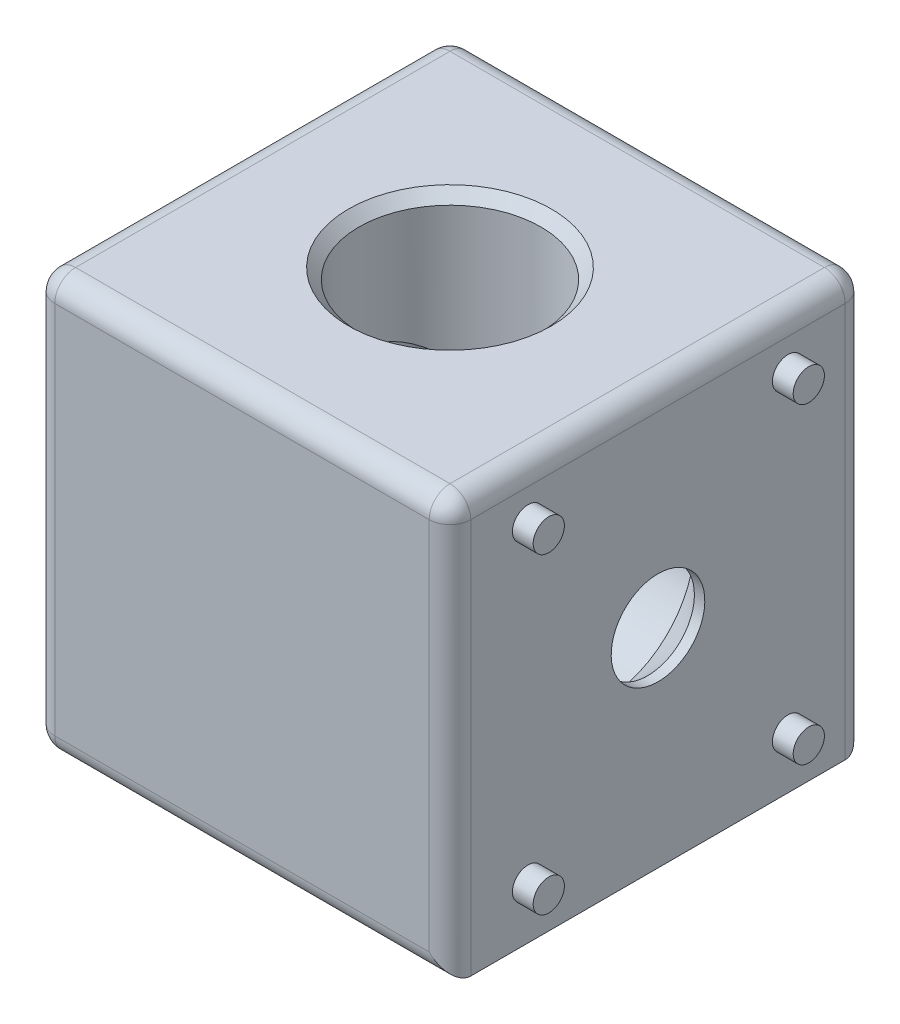
ISO-10303-21;
HEADER;
FILE_DESCRIPTION(('STEP AP214'),'2;1');
FILE_NAME('part.step','',(''),(''),'','','');
FILE_SCHEMA(('AUTOMOTIVE_DESIGN { 1 0 10303 214 1 1 1 1 }'));
ENDSEC;
DATA;
#1=APPLICATION_CONTEXT('core data for automotive mechanical design processes');
#2=APPLICATION_PROTOCOL_DEFINITION('international standard','automotive_design',2000,#1);
#3=PRODUCT_CONTEXT('',#1,'mechanical');
#4=PRODUCT('Part','Part','',(#3));
#5=PRODUCT_RELATED_PRODUCT_CATEGORY('part','',(#4));
#6=PRODUCT_DEFINITION_FORMATION('','',#4);
#7=PRODUCT_DEFINITION_CONTEXT('part definition',#1,'design');
#8=PRODUCT_DEFINITION('design','',#6,#7);
#9=PRODUCT_DEFINITION_SHAPE('','',#8);
#10=(LENGTH_UNIT() NAMED_UNIT(*) SI_UNIT(.MILLI.,.METRE.));
#11=(NAMED_UNIT(*) PLANE_ANGLE_UNIT() SI_UNIT($,.RADIAN.));
#12=(NAMED_UNIT(*) SI_UNIT($,.STERADIAN.) SOLID_ANGLE_UNIT());
#13=UNCERTAINTY_MEASURE_WITH_UNIT(LENGTH_MEASURE(1.E-05),#10,'distance_accuracy_value','');
#14=(GEOMETRIC_REPRESENTATION_CONTEXT(3) GLOBAL_UNCERTAINTY_ASSIGNED_CONTEXT((#13)) GLOBAL_UNIT_ASSIGNED_CONTEXT((#10,
#11,#12)) REPRESENTATION_CONTEXT('',''));
#15=CARTESIAN_POINT('',(0.,0.,0.));
#16=DIRECTION('',(0.,0.,1.));
#17=DIRECTION('',(1.,0.,0.));
#18=AXIS2_PLACEMENT_3D('',#15,#16,#17);
#19=CARTESIAN_POINT('',(0.,20.,0.));
#20=DIRECTION('',(0.,1.,0.));
#21=DIRECTION('',(-1.,0.,0.));
#22=AXIS2_PLACEMENT_3D('',#19,#20,#21);
#23=CYLINDRICAL_SURFACE('',#22,8.75);
#24=CARTESIAN_POINT('',(0.,19.,0.));
#25=DIRECTION('',(0.,1.,0.));
#26=DIRECTION('',(-1.,0.,0.));
#27=AXIS2_PLACEMENT_3D('',#24,#25,#26);
#28=CIRCLE('',#27,8.75);
#29=CARTESIAN_POINT('',(-8.75,19.,0.));
#30=VERTEX_POINT('',#29);
#31=EDGE_CURVE('E314',#30,#30,#28,.T.);
#32=ORIENTED_EDGE('',*,*,#31,.T.);
#33=EDGE_LOOP('',(#32));
#34=FACE_BOUND('',#33,.T.);
#35=CARTESIAN_POINT('',(0.,0.,0.));
#36=DIRECTION('',(0.707106781186547,0.707106781186548,0.));
#37=DIRECTION('',(-0.707106781186548,0.707106781186547,0.));
#38=AXIS2_PLACEMENT_3D('',#35,#36,#37);
#39=ELLIPSE('',#38,12.3743686707646,8.75);
#40=CARTESIAN_POINT('',(0.,0.,8.75));
#41=VERTEX_POINT('',#40);
#42=CARTESIAN_POINT('',(0.,0.,-8.75));
#43=VERTEX_POINT('',#42);
#44=EDGE_CURVE('E130',#41,#43,#39,.F.);
#45=ORIENTED_EDGE('',*,*,#44,.T.);
#46=CARTESIAN_POINT('',(0.,0.,0.));
#47=DIRECTION('',(-0.707106781186548,0.707106781186547,0.));
#48=DIRECTION('',(0.707106781186547,0.707106781186548,0.));
#49=AXIS2_PLACEMENT_3D('',#46,#47,#48);
#50=ELLIPSE('',#49,12.3743686707646,8.75);
#51=EDGE_CURVE('E126',#43,#41,#50,.F.);
#52=ORIENTED_EDGE('',*,*,#51,.T.);
#53=EDGE_LOOP('',(#45,#52));
#54=FACE_BOUND('',#53,.T.);
#55=ADVANCED_FACE('F34',(#34,#54),#23,.F.);
#56=CARTESIAN_POINT('',(20.,20.,20.));
#57=DIRECTION('',(-1.,0.,0.));
#58=DIRECTION('',(0.,0.,1.));
#59=AXIS2_PLACEMENT_3D('',#56,#57,#58);
#60=PLANE('',#59);
#61=DIRECTION('',(0.,0.,-1.));
#62=VECTOR('',#61,1.);
#63=CARTESIAN_POINT('',(20.,-20.,20.));
#64=LINE('',#63,#62);
#65=CARTESIAN_POINT('',(20.,-20.,18.));
#66=VERTEX_POINT('',#65);
#67=CARTESIAN_POINT('',(20.,-20.,-18.));
#68=VERTEX_POINT('',#67);
#69=EDGE_CURVE('E136',#66,#68,#64,.T.);
#70=ORIENTED_EDGE('',*,*,#69,.T.);
#71=DIRECTION('',(0.,-1.,0.));
#72=VECTOR('',#71,1.);
#73=CARTESIAN_POINT('',(20.,20.,-18.));
#74=LINE('',#73,#72);
#75=CARTESIAN_POINT('',(20.,18.,-18.));
#76=VERTEX_POINT('',#75);
#77=EDGE_CURVE('E163',#68,#76,#74,.F.);
#78=ORIENTED_EDGE('',*,*,#77,.T.);
#79=DIRECTION('',(0.,0.,-1.));
#80=VECTOR('',#79,1.);
#81=CARTESIAN_POINT('',(20.,18.,20.));
#82=LINE('',#81,#80);
#83=CARTESIAN_POINT('',(20.,18.,18.));
#84=VERTEX_POINT('',#83);
#85=EDGE_CURVE('E159',#76,#84,#82,.F.);
#86=ORIENTED_EDGE('',*,*,#85,.T.);
#87=DIRECTION('',(0.,-1.,0.));
#88=VECTOR('',#87,1.);
#89=CARTESIAN_POINT('',(20.,20.,18.));
#90=LINE('',#89,#88);
#91=EDGE_CURVE('E161',#84,#66,#90,.T.);
#92=ORIENTED_EDGE('',*,*,#91,.T.);
#93=EDGE_LOOP('',(#70,#78,#86,#92));
#94=FACE_BOUND('',#93,.T.);
#95=CARTESIAN_POINT('',(20.,-15.,12.5));
#96=DIRECTION('',(-1.,0.,0.));
#97=DIRECTION('',(0.,0.,-1.));
#98=AXIS2_PLACEMENT_3D('',#95,#96,#97);
#99=CIRCLE('',#98,1.5);
#100=CARTESIAN_POINT('',(20.,-15.,11.));
#101=VERTEX_POINT('',#100);
#102=EDGE_CURVE('E241',#101,#101,#99,.T.);
#103=ORIENTED_EDGE('',*,*,#102,.T.);
#104=EDGE_LOOP('',(#103));
#105=FACE_BOUND('',#104,.T.);
#106=CARTESIAN_POINT('',(20.,-15.,-12.5));
#107=DIRECTION('',(-1.,0.,0.));
#108=DIRECTION('',(0.,0.,-1.));
#109=AXIS2_PLACEMENT_3D('',#106,#107,#108);
#110=CIRCLE('',#109,1.5);
#111=CARTESIAN_POINT('',(20.,-15.,-14.));
#112=VERTEX_POINT('',#111);
#113=EDGE_CURVE('E252',#112,#112,#110,.T.);
#114=ORIENTED_EDGE('',*,*,#113,.T.);
#115=EDGE_LOOP('',(#114));
#116=FACE_BOUND('',#115,.T.);
#117=CARTESIAN_POINT('',(20.,15.,12.5));
#118=DIRECTION('',(-1.,0.,0.));
#119=DIRECTION('',(0.,0.,-1.));
#120=AXIS2_PLACEMENT_3D('',#117,#118,#119);
#121=CIRCLE('',#120,1.5);
#122=CARTESIAN_POINT('',(20.,15.,11.));
#123=VERTEX_POINT('',#122);
#124=EDGE_CURVE('E258',#123,#123,#121,.T.);
#125=ORIENTED_EDGE('',*,*,#124,.T.);
#126=EDGE_LOOP('',(#125));
#127=FACE_BOUND('',#126,.T.);
#128=CARTESIAN_POINT('',(20.,15.,-12.5));
#129=DIRECTION('',(-1.,0.,0.));
#130=DIRECTION('',(0.,0.,-1.));
#131=AXIS2_PLACEMENT_3D('',#128,#129,#130);
#132=CIRCLE('',#131,1.5);
#133=CARTESIAN_POINT('',(20.,15.,-14.));
#134=VERTEX_POINT('',#133);
#135=EDGE_CURVE('E264',#134,#134,#132,.T.);
#136=ORIENTED_EDGE('',*,*,#135,.T.);
#137=EDGE_LOOP('',(#136));
#138=FACE_BOUND('',#137,.T.);
#139=CARTESIAN_POINT('',(20.,0.,0.));
#140=DIRECTION('',(1.,0.,0.));
#141=DIRECTION('',(0.,1.,0.));
#142=AXIS2_PLACEMENT_3D('',#139,#140,#141);
#143=CIRCLE('',#142,4.5);
#144=CARTESIAN_POINT('',(20.,4.5,0.));
#145=VERTEX_POINT('',#144);
#146=EDGE_CURVE('E284',#145,#145,#143,.T.);
#147=ORIENTED_EDGE('',*,*,#146,.F.);
#148=EDGE_LOOP('',(#147));
#149=FACE_BOUND('',#148,.T.);
#150=ADVANCED_FACE('F329',(#94,#105,#116,#127,#138,#149),#60,.F.);
#151=CARTESIAN_POINT('',(-20.,20.,-20.));
#152=DIRECTION('',(0.,0.,1.));
#153=DIRECTION('',(1.,0.,0.));
#154=AXIS2_PLACEMENT_3D('',#151,#152,#153);
#155=PLANE('',#154);
#156=DIRECTION('',(0.,-1.,0.));
#157=VECTOR('',#156,1.);
#158=CARTESIAN_POINT('',(18.,20.,-20.));
#159=LINE('',#158,#157);
#160=CARTESIAN_POINT('',(18.,18.,-20.));
#161=VERTEX_POINT('',#160);
#162=CARTESIAN_POINT('',(18.,-18.,-20.));
#163=VERTEX_POINT('',#162);
#164=EDGE_CURVE('E147',#161,#163,#159,.T.);
#165=ORIENTED_EDGE('',*,*,#164,.T.);
#166=DIRECTION('',(-1.,0.,0.));
#167=VECTOR('',#166,1.);
#168=CARTESIAN_POINT('',(-20.,-18.,-20.));
#169=LINE('',#168,#167);
#170=CARTESIAN_POINT('',(-18.,-18.,-20.));
#171=VERTEX_POINT('',#170);
#172=EDGE_CURVE('E149',#163,#171,#169,.T.);
#173=ORIENTED_EDGE('',*,*,#172,.T.);
#174=DIRECTION('',(0.,-1.,0.));
#175=VECTOR('',#174,1.);
#176=CARTESIAN_POINT('',(-18.,20.,-20.));
#177=LINE('',#176,#175);
#178=CARTESIAN_POINT('',(-18.,18.,-20.));
#179=VERTEX_POINT('',#178);
#180=EDGE_CURVE('E145',#171,#179,#177,.F.);
#181=ORIENTED_EDGE('',*,*,#180,.T.);
#182=DIRECTION('',(-1.,0.,0.));
#183=VECTOR('',#182,1.);
#184=CARTESIAN_POINT('',(-20.,18.,-20.));
#185=LINE('',#184,#183);
#186=EDGE_CURVE('E138',#179,#161,#185,.F.);
#187=ORIENTED_EDGE('',*,*,#186,.T.);
#188=EDGE_LOOP('',(#165,#173,#181,#187));
#189=FACE_BOUND('',#188,.T.);
#190=ADVANCED_FACE('F370',(#189),#155,.F.);
#191=CARTESIAN_POINT('',(-20.,20.,20.));
#192=DIRECTION('',(1.,0.,0.));
#193=DIRECTION('',(0.,0.,-1.));
#194=AXIS2_PLACEMENT_3D('',#191,#192,#193);
#195=PLANE('',#194);
#196=DIRECTION('',(0.,-1.,0.));
#197=VECTOR('',#196,1.);
#198=CARTESIAN_POINT('',(-20.,20.,-18.));
#199=LINE('',#198,#197);
#200=CARTESIAN_POINT('',(-20.,18.,-18.));
#201=VERTEX_POINT('',#200);
#202=CARTESIAN_POINT('',(-20.,-18.,-18.));
#203=VERTEX_POINT('',#202);
#204=EDGE_CURVE('E174',#201,#203,#199,.T.);
#205=ORIENTED_EDGE('',*,*,#204,.T.);
#206=DIRECTION('',(0.,0.,1.));
#207=VECTOR('',#206,1.);
#208=CARTESIAN_POINT('',(-20.,-18.,20.));
#209=LINE('',#208,#207);
#210=CARTESIAN_POINT('',(-20.,-18.,18.));
#211=VERTEX_POINT('',#210);
#212=EDGE_CURVE('E180',#203,#211,#209,.T.);
#213=ORIENTED_EDGE('',*,*,#212,.T.);
#214=DIRECTION('',(0.,-1.,0.));
#215=VECTOR('',#214,1.);
#216=CARTESIAN_POINT('',(-20.,20.,18.));
#217=LINE('',#216,#215);
#218=CARTESIAN_POINT('',(-20.,18.,18.));
#219=VERTEX_POINT('',#218);
#220=EDGE_CURVE('E178',#211,#219,#217,.F.);
#221=ORIENTED_EDGE('',*,*,#220,.T.);
#222=DIRECTION('',(0.,0.,1.));
#223=VECTOR('',#222,1.);
#224=CARTESIAN_POINT('',(-20.,18.,20.));
#225=LINE('',#224,#223);
#226=EDGE_CURVE('E176',#219,#201,#225,.F.);
#227=ORIENTED_EDGE('',*,*,#226,.T.);
#228=EDGE_LOOP('',(#205,#213,#221,#227));
#229=FACE_BOUND('',#228,.T.);
#230=CARTESIAN_POINT('',(-20.,0.,0.));
#231=DIRECTION('',(1.,0.,0.));
#232=DIRECTION('',(0.,1.,0.));
#233=AXIS2_PLACEMENT_3D('',#230,#231,#232);
#234=CIRCLE('',#233,9.75);
#235=CARTESIAN_POINT('',(-20.,9.74999999999999,0.));
#236=VERTEX_POINT('',#235);
#237=EDGE_CURVE('E270',#236,#236,#234,.T.);
#238=ORIENTED_EDGE('',*,*,#237,.T.);
#239=EDGE_LOOP('',(#238));
#240=FACE_BOUND('',#239,.T.);
#241=ADVANCED_FACE('F427',(#229,#240),#195,.F.);
#242=CARTESIAN_POINT('',(-20.,20.,20.));
#243=DIRECTION('',(0.,0.,-1.));
#244=DIRECTION('',(-1.,0.,0.));
#245=AXIS2_PLACEMENT_3D('',#242,#243,#244);
#246=PLANE('',#245);
#247=DIRECTION('',(0.,-1.,0.));
#248=VECTOR('',#247,1.);
#249=CARTESIAN_POINT('',(-18.,20.,20.));
#250=LINE('',#249,#248);
#251=CARTESIAN_POINT('',(-18.,18.,20.));
#252=VERTEX_POINT('',#251);
#253=CARTESIAN_POINT('',(-18.,-18.,20.));
#254=VERTEX_POINT('',#253);
#255=EDGE_CURVE('E167',#252,#254,#250,.T.);
#256=ORIENTED_EDGE('',*,*,#255,.T.);
#257=DIRECTION('',(1.,0.,0.));
#258=VECTOR('',#257,1.);
#259=CARTESIAN_POINT('',(20.,-18.,20.));
#260=LINE('',#259,#258);
#261=CARTESIAN_POINT('',(18.,-18.,20.));
#262=VERTEX_POINT('',#261);
#263=EDGE_CURVE('E171',#254,#262,#260,.T.);
#264=ORIENTED_EDGE('',*,*,#263,.T.);
#265=DIRECTION('',(0.,-1.,0.));
#266=VECTOR('',#265,1.);
#267=CARTESIAN_POINT('',(18.,20.,20.));
#268=LINE('',#267,#266);
#269=CARTESIAN_POINT('',(18.,18.,20.));
#270=VERTEX_POINT('',#269);
#271=EDGE_CURVE('E169',#262,#270,#268,.F.);
#272=ORIENTED_EDGE('',*,*,#271,.T.);
#273=DIRECTION('',(1.,0.,0.));
#274=VECTOR('',#273,1.);
#275=CARTESIAN_POINT('',(-20.,18.,20.));
#276=LINE('',#275,#274);
#277=EDGE_CURVE('E165',#270,#252,#276,.F.);
#278=ORIENTED_EDGE('',*,*,#277,.T.);
#279=EDGE_LOOP('',(#256,#264,#272,#278));
#280=FACE_BOUND('',#279,.T.);
#281=ADVANCED_FACE('F389',(#280),#246,.F.);
#282=CARTESIAN_POINT('',(0.,20.,0.));
#283=DIRECTION('',(0.,-1.,0.));
#284=DIRECTION('',(0.,0.,-1.));
#285=AXIS2_PLACEMENT_3D('',#282,#283,#284);
#286=PLANE('',#285);
#287=DIRECTION('',(1.,0.,0.));
#288=VECTOR('',#287,1.);
#289=CARTESIAN_POINT('',(0.,20.,18.));
#290=LINE('',#289,#288);
#291=CARTESIAN_POINT('',(-18.,20.,18.));
#292=VERTEX_POINT('',#291);
#293=CARTESIAN_POINT('',(18.,20.,18.));
#294=VERTEX_POINT('',#293);
#295=EDGE_CURVE('E43',#292,#294,#290,.T.);
#296=ORIENTED_EDGE('',*,*,#295,.T.);
#297=DIRECTION('',(0.,0.,-1.));
#298=VECTOR('',#297,1.);
#299=CARTESIAN_POINT('',(18.,20.,0.));
#300=LINE('',#299,#298);
#301=CARTESIAN_POINT('',(18.,20.,-18.));
#302=VERTEX_POINT('',#301);
#303=EDGE_CURVE('E11',#294,#302,#300,.T.);
#304=ORIENTED_EDGE('',*,*,#303,.T.);
#305=DIRECTION('',(-1.,0.,0.));
#306=VECTOR('',#305,1.);
#307=CARTESIAN_POINT('',(0.,20.,-18.));
#308=LINE('',#307,#306);
#309=CARTESIAN_POINT('',(-18.,20.,-18.));
#310=VERTEX_POINT('',#309);
#311=EDGE_CURVE('E183',#302,#310,#308,.T.);
#312=ORIENTED_EDGE('',*,*,#311,.T.);
#313=DIRECTION('',(0.,0.,1.));
#314=VECTOR('',#313,1.);
#315=CARTESIAN_POINT('',(-18.,20.,0.));
#316=LINE('',#315,#314);
#317=EDGE_CURVE('E54',#310,#292,#316,.T.);
#318=ORIENTED_EDGE('',*,*,#317,.T.);
#319=EDGE_LOOP('',(#296,#304,#312,#318));
#320=FACE_BOUND('',#319,.T.);
#321=CARTESIAN_POINT('',(0.,20.,0.));
#322=DIRECTION('',(0.,1.,0.));
#323=DIRECTION('',(-1.,0.,0.));
#324=AXIS2_PLACEMENT_3D('',#321,#322,#323);
#325=CIRCLE('',#324,9.75);
#326=CARTESIAN_POINT('',(-9.75,20.,0.));
#327=VERTEX_POINT('',#326);
#328=EDGE_CURVE('E309',#327,#327,#325,.T.);
#329=ORIENTED_EDGE('',*,*,#328,.F.);
#330=EDGE_LOOP('',(#329));
#331=FACE_BOUND('',#330,.T.);
#332=ADVANCED_FACE('F386',(#320,#331),#286,.F.);
#333=CARTESIAN_POINT('',(0.,-20.,0.));
#334=DIRECTION('',(0.,-1.,0.));
#335=DIRECTION('',(0.,0.,-1.));
#336=AXIS2_PLACEMENT_3D('',#333,#334,#335);
#337=PLANE('',#336);
#338=CARTESIAN_POINT('',(15.,-20.,12.5));
#339=DIRECTION('',(0.,-1.,0.));
#340=DIRECTION('',(0.,0.,-1.));
#341=AXIS2_PLACEMENT_3D('',#338,#339,#340);
#342=CIRCLE('',#341,1.5);
#343=CARTESIAN_POINT('',(15.,-20.,11.));
#344=VERTEX_POINT('',#343);
#345=EDGE_CURVE('E287',#344,#344,#342,.T.);
#346=ORIENTED_EDGE('',*,*,#345,.F.);
#347=EDGE_LOOP('',(#346));
#348=FACE_BOUND('',#347,.T.);
#349=CARTESIAN_POINT('',(15.,-20.,-12.5));
#350=DIRECTION('',(0.,-1.,0.));
#351=DIRECTION('',(0.,0.,-1.));
#352=AXIS2_PLACEMENT_3D('',#349,#350,#351);
#353=CIRCLE('',#352,1.5);
#354=CARTESIAN_POINT('',(15.,-20.,-14.));
#355=VERTEX_POINT('',#354);
#356=EDGE_CURVE('E291',#355,#355,#353,.T.);
#357=ORIENTED_EDGE('',*,*,#356,.F.);
#358=EDGE_LOOP('',(#357));
#359=FACE_BOUND('',#358,.T.);
#360=CARTESIAN_POINT('',(-15.,-20.,12.5));
#361=DIRECTION('',(0.,-1.,0.));
#362=DIRECTION('',(0.,0.,-1.));
#363=AXIS2_PLACEMENT_3D('',#360,#361,#362);
#364=CIRCLE('',#363,1.5);
#365=CARTESIAN_POINT('',(-15.,-20.,11.));
#366=VERTEX_POINT('',#365);
#367=EDGE_CURVE('E297',#366,#366,#364,.T.);
#368=ORIENTED_EDGE('',*,*,#367,.F.);
#369=EDGE_LOOP('',(#368));
#370=FACE_BOUND('',#369,.T.);
#371=CARTESIAN_POINT('',(-15.,-20.,-12.5));
#372=DIRECTION('',(0.,-1.,0.));
#373=DIRECTION('',(0.,0.,-1.));
#374=AXIS2_PLACEMENT_3D('',#371,#372,#373);
#375=CIRCLE('',#374,1.5);
#376=CARTESIAN_POINT('',(-15.,-20.,-14.));
#377=VERTEX_POINT('',#376);
#378=EDGE_CURVE('E303',#377,#377,#375,.T.);
#379=ORIENTED_EDGE('',*,*,#378,.F.);
#380=EDGE_LOOP('',(#379));
#381=FACE_BOUND('',#380,.T.);
#382=CARTESIAN_POINT('',(0.,-20.,0.));
#383=DIRECTION('',(0.,1.,0.));
#384=DIRECTION('',(-1.,0.,0.));
#385=AXIS2_PLACEMENT_3D('',#382,#383,#384);
#386=CIRCLE('',#385,4.5);
#387=CARTESIAN_POINT('',(-4.5,-20.,0.));
#388=VERTEX_POINT('',#387);
#389=EDGE_CURVE('E323',#388,#388,#386,.T.);
#390=ORIENTED_EDGE('',*,*,#389,.T.);
#391=EDGE_LOOP('',(#390));
#392=FACE_BOUND('',#391,.T.);
#393=DIRECTION('',(0.,0.,1.));
#394=VECTOR('',#393,1.);
#395=CARTESIAN_POINT('',(-18.,-20.,-20.));
#396=LINE('',#395,#394);
#397=CARTESIAN_POINT('',(-18.,-20.,18.));
#398=VERTEX_POINT('',#397);
#399=CARTESIAN_POINT('',(-18.,-20.,-18.));
#400=VERTEX_POINT('',#399);
#401=EDGE_CURVE('E152',#398,#400,#396,.F.);
#402=ORIENTED_EDGE('',*,*,#401,.T.);
#403=DIRECTION('',(-1.,0.,0.));
#404=VECTOR('',#403,1.);
#405=CARTESIAN_POINT('',(20.,-20.,-18.));
#406=LINE('',#405,#404);
#407=EDGE_CURVE('E156',#400,#68,#406,.F.);
#408=ORIENTED_EDGE('',*,*,#407,.T.);
#409=ORIENTED_EDGE('',*,*,#69,.F.);
#410=DIRECTION('',(1.,0.,0.));
#411=VECTOR('',#410,1.);
#412=CARTESIAN_POINT('',(-20.,-20.,18.));
#413=LINE('',#412,#411);
#414=EDGE_CURVE('E154',#66,#398,#413,.F.);
#415=ORIENTED_EDGE('',*,*,#414,.T.);
#416=EDGE_LOOP('',(#402,#408,#409,#415));
#417=FACE_BOUND('',#416,.T.);
#418=ADVANCED_FACE('F335',(#348,#359,#370,#381,#392,#417),#337,.T.);
#419=CARTESIAN_POINT('',(0.,20.,0.));
#420=DIRECTION('',(0.,1.,0.));
#421=DIRECTION('',(-1.,0.,0.));
#422=AXIS2_PLACEMENT_3D('',#419,#420,#421);
#423=CYLINDRICAL_SURFACE('',#422,4.5);
#424=ORIENTED_EDGE('',*,*,#389,.F.);
#425=EDGE_LOOP('',(#424));
#426=FACE_BOUND('',#425,.T.);
#427=CARTESIAN_POINT('',(0.,-19.,0.));
#428=DIRECTION('',(0.,1.,0.));
#429=DIRECTION('',(-1.,0.,0.));
#430=AXIS2_PLACEMENT_3D('',#427,#428,#429);
#431=CIRCLE('',#430,4.5);
#432=CARTESIAN_POINT('',(-4.5,-19.,0.));
#433=VERTEX_POINT('',#432);
#434=EDGE_CURVE('E320',#433,#433,#431,.T.);
#435=ORIENTED_EDGE('',*,*,#434,.T.);
#436=EDGE_LOOP('',(#435));
#437=FACE_BOUND('',#436,.T.);
#438=ADVANCED_FACE('F417',(#426,#437),#423,.F.);
#439=CARTESIAN_POINT('',(0.,-14.75,0.));
#440=DIRECTION('',(0.,1.,0.));
#441=DIRECTION('',(-1.,0.,0.));
#442=AXIS2_PLACEMENT_3D('',#439,#440,#441);
#443=CONICAL_SURFACE('',#442,8.75,0.78539816339745);
#444=ORIENTED_EDGE('',*,*,#434,.F.);
#445=EDGE_LOOP('',(#444));
#446=FACE_BOUND('',#445,.T.);
#447=CARTESIAN_POINT('',(0.,-14.75,0.));
#448=DIRECTION('',(0.,1.,0.));
#449=DIRECTION('',(-1.,0.,0.));
#450=AXIS2_PLACEMENT_3D('',#447,#448,#449);
#451=CIRCLE('',#450,8.75);
#452=CARTESIAN_POINT('',(-8.75,-14.75,0.));
#453=VERTEX_POINT('',#452);
#454=EDGE_CURVE('E317',#453,#453,#451,.T.);
#455=ORIENTED_EDGE('',*,*,#454,.T.);
#456=EDGE_LOOP('',(#455));
#457=FACE_BOUND('',#456,.T.);
#458=ADVANCED_FACE('F405',(#446,#457),#443,.F.);
#459=CARTESIAN_POINT('',(0.,0.,0.));
#460=DIRECTION('',(0.707106781186547,0.707106781186548,0.));
#461=DIRECTION('',(-0.707106781186548,0.707106781186547,0.));
#462=AXIS2_PLACEMENT_3D('',#459,#460,#461);
#463=ELLIPSE('',#462,12.3743686707646,8.75);
#464=EDGE_CURVE('E122',#41,#43,#463,.T.);
#465=ORIENTED_EDGE('',*,*,#464,.T.);
#466=CARTESIAN_POINT('',(0.,0.,0.));
#467=DIRECTION('',(-0.707106781186548,0.707106781186547,0.));
#468=DIRECTION('',(0.707106781186547,0.707106781186548,0.));
#469=AXIS2_PLACEMENT_3D('',#466,#467,#468);
#470=ELLIPSE('',#469,12.3743686707646,8.75);
#471=EDGE_CURVE('E129',#43,#41,#470,.T.);
#472=ORIENTED_EDGE('',*,*,#471,.T.);
#473=EDGE_LOOP('',(#465,#472));
#474=FACE_BOUND('',#473,.T.);
#475=ORIENTED_EDGE('',*,*,#454,.F.);
#476=EDGE_LOOP('',(#475));
#477=FACE_BOUND('',#476,.T.);
#478=ADVANCED_FACE('F140',(#474,#477),#23,.F.);
#479=CARTESIAN_POINT('',(0.,20.,0.));
#480=DIRECTION('',(0.,1.,0.));
#481=DIRECTION('',(-1.,0.,0.));
#482=AXIS2_PLACEMENT_3D('',#479,#480,#481);
#483=CONICAL_SURFACE('',#482,9.75,0.78539816339745);
#484=ORIENTED_EDGE('',*,*,#31,.F.);
#485=EDGE_LOOP('',(#484));
#486=FACE_BOUND('',#485,.T.);
#487=ORIENTED_EDGE('',*,*,#328,.T.);
#488=EDGE_LOOP('',(#487));
#489=FACE_BOUND('',#488,.T.);
#490=ADVANCED_FACE('F393',(#486,#489),#483,.F.);
#491=CARTESIAN_POINT('',(-15.,-22.,-12.5));
#492=DIRECTION('',(0.,1.,0.));
#493=DIRECTION('',(0.,0.,1.));
#494=AXIS2_PLACEMENT_3D('',#491,#492,#493);
#495=CYLINDRICAL_SURFACE('',#494,1.5);
#496=CARTESIAN_POINT('',(-15.,-22.,-12.5));
#497=DIRECTION('',(0.,-1.,0.));
#498=DIRECTION('',(0.,0.,-1.));
#499=AXIS2_PLACEMENT_3D('',#496,#497,#498);
#500=CIRCLE('',#499,1.5);
#501=CARTESIAN_POINT('',(-15.,-22.,-14.));
#502=VERTEX_POINT('',#501);
#503=EDGE_CURVE('E306',#502,#502,#500,.T.);
#504=ORIENTED_EDGE('',*,*,#503,.F.);
#505=EDGE_LOOP('',(#504));
#506=FACE_BOUND('',#505,.T.);
#507=ORIENTED_EDGE('',*,*,#378,.T.);
#508=EDGE_LOOP('',(#507));
#509=FACE_BOUND('',#508,.T.);
#510=ADVANCED_FACE('F395',(#506,#509),#495,.T.);
#511=CARTESIAN_POINT('',(-15.,-22.,-12.5));
#512=DIRECTION('',(0.,-1.,0.));
#513=DIRECTION('',(0.,0.,-1.));
#514=AXIS2_PLACEMENT_3D('',#511,#512,#513);
#515=PLANE('',#514);
#516=ORIENTED_EDGE('',*,*,#503,.T.);
#517=EDGE_LOOP('',(#516));
#518=FACE_BOUND('',#517,.T.);
#519=ADVANCED_FACE('F402',(#518),#515,.T.);
#520=CARTESIAN_POINT('',(-15.,-22.,12.5));
#521=DIRECTION('',(0.,1.,0.));
#522=DIRECTION('',(0.,0.,1.));
#523=AXIS2_PLACEMENT_3D('',#520,#521,#522);
#524=CYLINDRICAL_SURFACE('',#523,1.5);
#525=CARTESIAN_POINT('',(-15.,-22.,12.5));
#526=DIRECTION('',(0.,-1.,0.));
#527=DIRECTION('',(0.,0.,-1.));
#528=AXIS2_PLACEMENT_3D('',#525,#526,#527);
#529=CIRCLE('',#528,1.5);
#530=CARTESIAN_POINT('',(-15.,-22.,11.));
#531=VERTEX_POINT('',#530);
#532=EDGE_CURVE('E300',#531,#531,#529,.T.);
#533=ORIENTED_EDGE('',*,*,#532,.F.);
#534=EDGE_LOOP('',(#533));
#535=FACE_BOUND('',#534,.T.);
#536=ORIENTED_EDGE('',*,*,#367,.T.);
#537=EDGE_LOOP('',(#536));
#538=FACE_BOUND('',#537,.T.);
#539=ADVANCED_FACE('F526',(#535,#538),#524,.T.);
#540=CARTESIAN_POINT('',(-15.,-22.,12.5));
#541=DIRECTION('',(0.,-1.,0.));
#542=DIRECTION('',(0.,0.,-1.));
#543=AXIS2_PLACEMENT_3D('',#540,#541,#542);
#544=PLANE('',#543);
#545=ORIENTED_EDGE('',*,*,#532,.T.);
#546=EDGE_LOOP('',(#545));
#547=FACE_BOUND('',#546,.T.);
#548=ADVANCED_FACE('F522',(#547),#544,.T.);
#549=CARTESIAN_POINT('',(15.,-22.,-12.5));
#550=DIRECTION('',(0.,1.,0.));
#551=DIRECTION('',(0.,0.,1.));
#552=AXIS2_PLACEMENT_3D('',#549,#550,#551);
#553=CYLINDRICAL_SURFACE('',#552,1.5);
#554=CARTESIAN_POINT('',(15.,-22.,-12.5));
#555=DIRECTION('',(0.,-1.,0.));
#556=DIRECTION('',(0.,0.,-1.));
#557=AXIS2_PLACEMENT_3D('',#554,#555,#556);
#558=CIRCLE('',#557,1.5);
#559=CARTESIAN_POINT('',(15.,-22.,-14.));
#560=VERTEX_POINT('',#559);
#561=EDGE_CURVE('E294',#560,#560,#558,.T.);
#562=ORIENTED_EDGE('',*,*,#561,.F.);
#563=EDGE_LOOP('',(#562));
#564=FACE_BOUND('',#563,.T.);
#565=ORIENTED_EDGE('',*,*,#356,.T.);
#566=EDGE_LOOP('',(#565));
#567=FACE_BOUND('',#566,.T.);
#568=ADVANCED_FACE('F518',(#564,#567),#553,.T.);
#569=CARTESIAN_POINT('',(15.,-22.,-12.5));
#570=DIRECTION('',(0.,-1.,0.));
#571=DIRECTION('',(0.,0.,-1.));
#572=AXIS2_PLACEMENT_3D('',#569,#570,#571);
#573=PLANE('',#572);
#574=ORIENTED_EDGE('',*,*,#561,.T.);
#575=EDGE_LOOP('',(#574));
#576=FACE_BOUND('',#575,.T.);
#577=ADVANCED_FACE('F514',(#576),#573,.T.);
#578=CARTESIAN_POINT('',(15.,-22.,12.5));
#579=DIRECTION('',(0.,1.,0.));
#580=DIRECTION('',(0.,0.,1.));
#581=AXIS2_PLACEMENT_3D('',#578,#579,#580);
#582=CYLINDRICAL_SURFACE('',#581,1.5);
#583=CARTESIAN_POINT('',(15.,-22.,12.5));
#584=DIRECTION('',(0.,-1.,0.));
#585=DIRECTION('',(0.,0.,-1.));
#586=AXIS2_PLACEMENT_3D('',#583,#584,#585);
#587=CIRCLE('',#586,1.5);
#588=CARTESIAN_POINT('',(15.,-22.,11.));
#589=VERTEX_POINT('',#588);
#590=EDGE_CURVE('E288',#589,#589,#587,.T.);
#591=ORIENTED_EDGE('',*,*,#590,.F.);
#592=EDGE_LOOP('',(#591));
#593=FACE_BOUND('',#592,.T.);
#594=ORIENTED_EDGE('',*,*,#345,.T.);
#595=EDGE_LOOP('',(#594));
#596=FACE_BOUND('',#595,.T.);
#597=ADVANCED_FACE('F510',(#593,#596),#582,.T.);
#598=CARTESIAN_POINT('',(15.,-22.,12.5));
#599=DIRECTION('',(0.,-1.,0.));
#600=DIRECTION('',(0.,0.,-1.));
#601=AXIS2_PLACEMENT_3D('',#598,#599,#600);
#602=PLANE('',#601);
#603=ORIENTED_EDGE('',*,*,#590,.T.);
#604=EDGE_LOOP('',(#603));
#605=FACE_BOUND('',#604,.T.);
#606=ADVANCED_FACE('F495',(#605),#602,.T.);
#607=CARTESIAN_POINT('',(-20.,0.,0.));
#608=DIRECTION('',(-1.,0.,0.));
#609=DIRECTION('',(0.,1.,0.));
#610=AXIS2_PLACEMENT_3D('',#607,#608,#609);
#611=CYLINDRICAL_SURFACE('',#610,8.75);
#612=CARTESIAN_POINT('',(-19.,0.,0.));
#613=DIRECTION('',(1.,0.,0.));
#614=DIRECTION('',(0.,1.,0.));
#615=AXIS2_PLACEMENT_3D('',#612,#613,#614);
#616=CIRCLE('',#615,8.75);
#617=CARTESIAN_POINT('',(-19.,8.74999999999999,0.));
#618=VERTEX_POINT('',#617);
#619=EDGE_CURVE('E275',#618,#618,#616,.T.);
#620=ORIENTED_EDGE('',*,*,#619,.F.);
#621=EDGE_LOOP('',(#620));
#622=FACE_BOUND('',#621,.T.);
#623=ORIENTED_EDGE('',*,*,#44,.F.);
#624=ORIENTED_EDGE('',*,*,#471,.F.);
#625=EDGE_LOOP('',(#623,#624));
#626=FACE_BOUND('',#625,.T.);
#627=ADVANCED_FACE('F134',(#622,#626),#611,.F.);
#628=CARTESIAN_POINT('',(-20.,0.,0.));
#629=DIRECTION('',(-1.,0.,0.));
#630=DIRECTION('',(0.,1.,0.));
#631=AXIS2_PLACEMENT_3D('',#628,#629,#630);
#632=CONICAL_SURFACE('',#631,9.75,0.78539816339745);
#633=ORIENTED_EDGE('',*,*,#619,.T.);
#634=EDGE_LOOP('',(#633));
#635=FACE_BOUND('',#634,.T.);
#636=ORIENTED_EDGE('',*,*,#237,.F.);
#637=EDGE_LOOP('',(#636));
#638=FACE_BOUND('',#637,.T.);
#639=ADVANCED_FACE('F484',(#635,#638),#632,.F.);
#640=CARTESIAN_POINT('',(14.75,0.,0.));
#641=DIRECTION('',(1.,0.,0.));
#642=DIRECTION('',(0.,1.,0.));
#643=AXIS2_PLACEMENT_3D('',#640,#641,#642);
#644=CIRCLE('',#643,8.75);
#645=CARTESIAN_POINT('',(14.75,8.75,0.));
#646=VERTEX_POINT('',#645);
#647=EDGE_CURVE('E278',#646,#646,#644,.T.);
#648=ORIENTED_EDGE('',*,*,#647,.T.);
#649=EDGE_LOOP('',(#648));
#650=FACE_BOUND('',#649,.T.);
#651=ORIENTED_EDGE('',*,*,#464,.F.);
#652=ORIENTED_EDGE('',*,*,#51,.F.);
#653=EDGE_LOOP('',(#651,#652));
#654=FACE_BOUND('',#653,.T.);
#655=ADVANCED_FACE('F124',(#650,#654),#611,.F.);
#656=CARTESIAN_POINT('',(-20.,0.,0.));
#657=DIRECTION('',(-1.,0.,0.));
#658=DIRECTION('',(0.,1.,0.));
#659=AXIS2_PLACEMENT_3D('',#656,#657,#658);
#660=CYLINDRICAL_SURFACE('',#659,4.5);
#661=ORIENTED_EDGE('',*,*,#146,.T.);
#662=EDGE_LOOP('',(#661));
#663=FACE_BOUND('',#662,.T.);
#664=CARTESIAN_POINT('',(19.,0.,0.));
#665=DIRECTION('',(1.,0.,0.));
#666=DIRECTION('',(0.,1.,0.));
#667=AXIS2_PLACEMENT_3D('',#664,#665,#666);
#668=CIRCLE('',#667,4.5);
#669=CARTESIAN_POINT('',(19.,4.50000000000001,0.));
#670=VERTEX_POINT('',#669);
#671=EDGE_CURVE('E281',#670,#670,#668,.T.);
#672=ORIENTED_EDGE('',*,*,#671,.F.);
#673=EDGE_LOOP('',(#672));
#674=FACE_BOUND('',#673,.T.);
#675=ADVANCED_FACE('F492',(#663,#674),#660,.F.);
#676=CARTESIAN_POINT('',(14.75,0.,0.));
#677=DIRECTION('',(-1.,0.,0.));
#678=DIRECTION('',(0.,1.,0.));
#679=AXIS2_PLACEMENT_3D('',#676,#677,#678);
#680=CONICAL_SURFACE('',#679,8.75,0.78539816339745);
#681=ORIENTED_EDGE('',*,*,#671,.T.);
#682=EDGE_LOOP('',(#681));
#683=FACE_BOUND('',#682,.T.);
#684=ORIENTED_EDGE('',*,*,#647,.F.);
#685=EDGE_LOOP('',(#684));
#686=FACE_BOUND('',#685,.T.);
#687=ADVANCED_FACE('F501',(#683,#686),#680,.F.);
#688=CARTESIAN_POINT('',(22.,15.,-12.5));
#689=DIRECTION('',(-1.,0.,0.));
#690=DIRECTION('',(0.,-1.,0.));
#691=AXIS2_PLACEMENT_3D('',#688,#689,#690);
#692=CYLINDRICAL_SURFACE('',#691,1.5);
#693=CARTESIAN_POINT('',(22.,15.,-12.5));
#694=DIRECTION('',(-1.,0.,0.));
#695=DIRECTION('',(0.,0.,-1.));
#696=AXIS2_PLACEMENT_3D('',#693,#694,#695);
#697=CIRCLE('',#696,1.5);
#698=CARTESIAN_POINT('',(22.,15.,-14.));
#699=VERTEX_POINT('',#698);
#700=EDGE_CURVE('E267',#699,#699,#697,.T.);
#701=ORIENTED_EDGE('',*,*,#700,.T.);
#702=EDGE_LOOP('',(#701));
#703=FACE_BOUND('',#702,.T.);
#704=ORIENTED_EDGE('',*,*,#135,.F.);
#705=EDGE_LOOP('',(#704));
#706=FACE_BOUND('',#705,.T.);
#707=ADVANCED_FACE('F498',(#703,#706),#692,.T.);
#708=CARTESIAN_POINT('',(22.,15.,-12.5));
#709=DIRECTION('',(1.,0.,0.));
#710=DIRECTION('',(0.,0.,-1.));
#711=AXIS2_PLACEMENT_3D('',#708,#709,#710);
#712=PLANE('',#711);
#713=ORIENTED_EDGE('',*,*,#700,.F.);
#714=EDGE_LOOP('',(#713));
#715=FACE_BOUND('',#714,.T.);
#716=ADVANCED_FACE('F610',(#715),#712,.T.);
#717=CARTESIAN_POINT('',(22.,15.,12.5));
#718=DIRECTION('',(-1.,0.,0.));
#719=DIRECTION('',(0.,-1.,0.));
#720=AXIS2_PLACEMENT_3D('',#717,#718,#719);
#721=CYLINDRICAL_SURFACE('',#720,1.5);
#722=CARTESIAN_POINT('',(22.,15.,12.5));
#723=DIRECTION('',(-1.,0.,0.));
#724=DIRECTION('',(0.,0.,-1.));
#725=AXIS2_PLACEMENT_3D('',#722,#723,#724);
#726=CIRCLE('',#725,1.5);
#727=CARTESIAN_POINT('',(22.,15.,11.));
#728=VERTEX_POINT('',#727);
#729=EDGE_CURVE('E261',#728,#728,#726,.T.);
#730=ORIENTED_EDGE('',*,*,#729,.T.);
#731=EDGE_LOOP('',(#730));
#732=FACE_BOUND('',#731,.T.);
#733=ORIENTED_EDGE('',*,*,#124,.F.);
#734=EDGE_LOOP('',(#733));
#735=FACE_BOUND('',#734,.T.);
#736=ADVANCED_FACE('F619',(#732,#735),#721,.T.);
#737=CARTESIAN_POINT('',(22.,15.,12.5));
#738=DIRECTION('',(1.,0.,0.));
#739=DIRECTION('',(0.,0.,-1.));
#740=AXIS2_PLACEMENT_3D('',#737,#738,#739);
#741=PLANE('',#740);
#742=ORIENTED_EDGE('',*,*,#729,.F.);
#743=EDGE_LOOP('',(#742));
#744=FACE_BOUND('',#743,.T.);
#745=ADVANCED_FACE('F628',(#744),#741,.T.);
#746=CARTESIAN_POINT('',(22.,-15.,-12.5));
#747=DIRECTION('',(-1.,0.,0.));
#748=DIRECTION('',(0.,-1.,0.));
#749=AXIS2_PLACEMENT_3D('',#746,#747,#748);
#750=CYLINDRICAL_SURFACE('',#749,1.5);
#751=CARTESIAN_POINT('',(22.,-15.,-12.5));
#752=DIRECTION('',(-1.,0.,0.));
#753=DIRECTION('',(0.,0.,-1.));
#754=AXIS2_PLACEMENT_3D('',#751,#752,#753);
#755=CIRCLE('',#754,1.5);
#756=CARTESIAN_POINT('',(22.,-15.,-14.));
#757=VERTEX_POINT('',#756);
#758=EDGE_CURVE('E255',#757,#757,#755,.T.);
#759=ORIENTED_EDGE('',*,*,#758,.T.);
#760=EDGE_LOOP('',(#759));
#761=FACE_BOUND('',#760,.T.);
#762=ORIENTED_EDGE('',*,*,#113,.F.);
#763=EDGE_LOOP('',(#762));
#764=FACE_BOUND('',#763,.T.);
#765=ADVANCED_FACE('F638',(#761,#764),#750,.T.);
#766=CARTESIAN_POINT('',(22.,-15.,-12.5));
#767=DIRECTION('',(1.,0.,0.));
#768=DIRECTION('',(0.,0.,-1.));
#769=AXIS2_PLACEMENT_3D('',#766,#767,#768);
#770=PLANE('',#769);
#771=ORIENTED_EDGE('',*,*,#758,.F.);
#772=EDGE_LOOP('',(#771));
#773=FACE_BOUND('',#772,.T.);
#774=ADVANCED_FACE('F648',(#773),#770,.T.);
#775=CARTESIAN_POINT('',(22.,-15.,12.5));
#776=DIRECTION('',(-1.,0.,0.));
#777=DIRECTION('',(0.,-1.,0.));
#778=AXIS2_PLACEMENT_3D('',#775,#776,#777);
#779=CYLINDRICAL_SURFACE('',#778,1.5);
#780=CARTESIAN_POINT('',(22.,-15.,12.5));
#781=DIRECTION('',(-1.,0.,0.));
#782=DIRECTION('',(0.,0.,-1.));
#783=AXIS2_PLACEMENT_3D('',#780,#781,#782);
#784=CIRCLE('',#783,1.5);
#785=CARTESIAN_POINT('',(22.,-15.,11.));
#786=VERTEX_POINT('',#785);
#787=EDGE_CURVE('E247',#786,#786,#784,.T.);
#788=ORIENTED_EDGE('',*,*,#787,.T.);
#789=EDGE_LOOP('',(#788));
#790=FACE_BOUND('',#789,.T.);
#791=ORIENTED_EDGE('',*,*,#102,.F.);
#792=EDGE_LOOP('',(#791));
#793=FACE_BOUND('',#792,.T.);
#794=ADVANCED_FACE('F658',(#790,#793),#779,.T.);
#795=CARTESIAN_POINT('',(22.,-15.,12.5));
#796=DIRECTION('',(1.,0.,0.));
#797=DIRECTION('',(0.,0.,-1.));
#798=AXIS2_PLACEMENT_3D('',#795,#796,#797);
#799=PLANE('',#798);
#800=ORIENTED_EDGE('',*,*,#787,.F.);
#801=EDGE_LOOP('',(#800));
#802=FACE_BOUND('',#801,.T.);
#803=ADVANCED_FACE('F475',(#802),#799,.T.);
#804=CARTESIAN_POINT('',(0.,18.,18.));
#805=DIRECTION('',(1.,0.,0.));
#806=DIRECTION('',(0.,0.,-1.));
#807=AXIS2_PLACEMENT_3D('',#804,#805,#806);
#808=CYLINDRICAL_SURFACE('',#807,2.);
#809=CARTESIAN_POINT('',(-18.,18.,18.));
#810=DIRECTION('',(-1.,0.,0.));
#811=DIRECTION('',(0.,0.,1.));
#812=AXIS2_PLACEMENT_3D('',#809,#810,#811);
#813=CIRCLE('',#812,2.);
#814=EDGE_CURVE('E38',#252,#292,#813,.T.);
#815=ORIENTED_EDGE('',*,*,#814,.F.);
#816=ORIENTED_EDGE('',*,*,#277,.F.);
#817=CARTESIAN_POINT('',(18.,18.,18.));
#818=DIRECTION('',(1.,0.,0.));
#819=DIRECTION('',(0.,0.,-1.));
#820=AXIS2_PLACEMENT_3D('',#817,#818,#819);
#821=CIRCLE('',#820,2.);
#822=EDGE_CURVE('E233',#294,#270,#821,.T.);
#823=ORIENTED_EDGE('',*,*,#822,.F.);
#824=ORIENTED_EDGE('',*,*,#295,.F.);
#825=EDGE_LOOP('',(#815,#816,#823,#824));
#826=FACE_BOUND('',#825,.T.);
#827=ADVANCED_FACE('F36',(#826),#808,.T.);
#828=CARTESIAN_POINT('',(-18.,18.,18.));
#829=DIRECTION('',(0.,1.,0.));
#830=DIRECTION('',(0.,0.,1.));
#831=AXIS2_PLACEMENT_3D('',#828,#829,#830);
#832=SPHERICAL_SURFACE('',#831,2.);
#833=CARTESIAN_POINT('',(-18.,18.,18.));
#834=DIRECTION('',(0.,1.,0.));
#835=DIRECTION('',(0.,0.,1.));
#836=AXIS2_PLACEMENT_3D('',#833,#834,#835);
#837=CIRCLE('',#836,2.);
#838=EDGE_CURVE('E227',#252,#219,#837,.F.);
#839=ORIENTED_EDGE('',*,*,#838,.F.);
#840=ORIENTED_EDGE('',*,*,#814,.T.);
#841=CARTESIAN_POINT('',(-18.,18.,18.));
#842=DIRECTION('',(0.,0.,1.));
#843=DIRECTION('',(1.,0.,0.));
#844=AXIS2_PLACEMENT_3D('',#841,#842,#843);
#845=CIRCLE('',#844,2.);
#846=EDGE_CURVE('E230',#219,#292,#845,.F.);
#847=ORIENTED_EDGE('',*,*,#846,.F.);
#848=EDGE_LOOP('',(#839,#840,#847));
#849=FACE_BOUND('',#848,.T.);
#850=ADVANCED_FACE('F470',(#849),#832,.T.);
#851=CARTESIAN_POINT('',(18.,20.,18.));
#852=DIRECTION('',(0.,-1.,0.));
#853=DIRECTION('',(0.,0.,-1.));
#854=AXIS2_PLACEMENT_3D('',#851,#852,#853);
#855=CYLINDRICAL_SURFACE('',#854,2.);
#856=CARTESIAN_POINT('',(18.,18.,18.));
#857=DIRECTION('',(0.,1.,0.));
#858=DIRECTION('',(0.,0.,1.));
#859=AXIS2_PLACEMENT_3D('',#856,#857,#858);
#860=CIRCLE('',#859,2.);
#861=EDGE_CURVE('E235',#270,#84,#860,.T.);
#862=ORIENTED_EDGE('',*,*,#861,.F.);
#863=ORIENTED_EDGE('',*,*,#271,.F.);
#864=CARTESIAN_POINT('',(18.,-18.,18.));
#865=DIRECTION('',(-0.707106781186547,-0.707106781186547,0.));
#866=DIRECTION('',(0.707106781186547,-0.707106781186547,0.));
#867=AXIS2_PLACEMENT_3D('',#864,#865,#866);
#868=ELLIPSE('',#867,2.82842712474619,2.);
#869=EDGE_CURVE('E225',#66,#262,#868,.T.);
#870=ORIENTED_EDGE('',*,*,#869,.F.);
#871=ORIENTED_EDGE('',*,*,#91,.F.);
#872=EDGE_LOOP('',(#862,#863,#870,#871));
#873=FACE_BOUND('',#872,.T.);
#874=ADVANCED_FACE('F341',(#873),#855,.T.);
#875=CARTESIAN_POINT('',(18.,18.,18.));
#876=DIRECTION('',(0.,0.,1.));
#877=DIRECTION('',(1.,0.,0.));
#878=AXIS2_PLACEMENT_3D('',#875,#876,#877);
#879=SPHERICAL_SURFACE('',#878,2.);
#880=ORIENTED_EDGE('',*,*,#822,.T.);
#881=ORIENTED_EDGE('',*,*,#861,.T.);
#882=CARTESIAN_POINT('',(18.,18.,18.));
#883=DIRECTION('',(0.,0.,1.));
#884=DIRECTION('',(1.,0.,0.));
#885=AXIS2_PLACEMENT_3D('',#882,#883,#884);
#886=CIRCLE('',#885,2.);
#887=EDGE_CURVE('E222',#294,#84,#886,.F.);
#888=ORIENTED_EDGE('',*,*,#887,.F.);
#889=EDGE_LOOP('',(#880,#881,#888));
#890=FACE_BOUND('',#889,.T.);
#891=ADVANCED_FACE('F465',(#890),#879,.T.);
#892=CARTESIAN_POINT('',(-18.,18.,0.));
#893=DIRECTION('',(0.,0.,1.));
#894=DIRECTION('',(1.,0.,0.));
#895=AXIS2_PLACEMENT_3D('',#892,#893,#894);
#896=CYLINDRICAL_SURFACE('',#895,2.);
#897=ORIENTED_EDGE('',*,*,#846,.T.);
#898=ORIENTED_EDGE('',*,*,#317,.F.);
#899=CARTESIAN_POINT('',(-18.,18.,-18.));
#900=DIRECTION('',(0.,0.,-1.));
#901=DIRECTION('',(-1.,0.,0.));
#902=AXIS2_PLACEMENT_3D('',#899,#900,#901);
#903=CIRCLE('',#902,2.);
#904=EDGE_CURVE('E216',#201,#310,#903,.T.);
#905=ORIENTED_EDGE('',*,*,#904,.F.);
#906=ORIENTED_EDGE('',*,*,#226,.F.);
#907=EDGE_LOOP('',(#897,#898,#905,#906));
#908=FACE_BOUND('',#907,.T.);
#909=ADVANCED_FACE('F461',(#908),#896,.T.);
#910=CARTESIAN_POINT('',(-18.,20.,18.));
#911=DIRECTION('',(0.,-1.,0.));
#912=DIRECTION('',(0.,0.,-1.));
#913=AXIS2_PLACEMENT_3D('',#910,#911,#912);
#914=CYLINDRICAL_SURFACE('',#913,2.);
#915=ORIENTED_EDGE('',*,*,#838,.T.);
#916=ORIENTED_EDGE('',*,*,#220,.F.);
#917=CARTESIAN_POINT('',(-18.,-18.,18.));
#918=DIRECTION('',(0.,-1.,0.));
#919=DIRECTION('',(0.,0.,-1.));
#920=AXIS2_PLACEMENT_3D('',#917,#918,#919);
#921=CIRCLE('',#920,2.);
#922=EDGE_CURVE('E213',#254,#211,#921,.T.);
#923=ORIENTED_EDGE('',*,*,#922,.F.);
#924=ORIENTED_EDGE('',*,*,#255,.F.);
#925=EDGE_LOOP('',(#915,#916,#923,#924));
#926=FACE_BOUND('',#925,.T.);
#927=ADVANCED_FACE('F458',(#926),#914,.T.);
#928=CARTESIAN_POINT('',(-20.,-18.,18.));
#929=DIRECTION('',(-1.,0.,0.));
#930=DIRECTION('',(0.,0.,1.));
#931=AXIS2_PLACEMENT_3D('',#928,#929,#930);
#932=CYLINDRICAL_SURFACE('',#931,2.);
#933=ORIENTED_EDGE('',*,*,#869,.T.);
#934=ORIENTED_EDGE('',*,*,#263,.F.);
#935=CARTESIAN_POINT('',(-18.,-18.,18.));
#936=DIRECTION('',(-1.,0.,0.));
#937=DIRECTION('',(0.,0.,1.));
#938=AXIS2_PLACEMENT_3D('',#935,#936,#937);
#939=CIRCLE('',#938,2.);
#940=EDGE_CURVE('E210',#398,#254,#939,.T.);
#941=ORIENTED_EDGE('',*,*,#940,.F.);
#942=ORIENTED_EDGE('',*,*,#414,.F.);
#943=EDGE_LOOP('',(#933,#934,#941,#942));
#944=FACE_BOUND('',#943,.T.);
#945=ADVANCED_FACE('F344',(#944),#932,.T.);
#946=CARTESIAN_POINT('',(18.,18.,0.));
#947=DIRECTION('',(0.,0.,-1.));
#948=DIRECTION('',(-1.,0.,0.));
#949=AXIS2_PLACEMENT_3D('',#946,#947,#948);
#950=CYLINDRICAL_SURFACE('',#949,2.);
#951=ORIENTED_EDGE('',*,*,#887,.T.);
#952=ORIENTED_EDGE('',*,*,#85,.F.);
#953=CARTESIAN_POINT('',(18.,18.,-18.));
#954=DIRECTION('',(0.,0.,-1.));
#955=DIRECTION('',(-1.,0.,0.));
#956=AXIS2_PLACEMENT_3D('',#953,#954,#955);
#957=CIRCLE('',#956,2.);
#958=EDGE_CURVE('E207',#302,#76,#957,.T.);
#959=ORIENTED_EDGE('',*,*,#958,.F.);
#960=ORIENTED_EDGE('',*,*,#303,.F.);
#961=EDGE_LOOP('',(#951,#952,#959,#960));
#962=FACE_BOUND('',#961,.T.);
#963=ADVANCED_FACE('F382',(#962),#950,.T.);
#964=CARTESIAN_POINT('',(0.,18.,-18.));
#965=DIRECTION('',(-1.,0.,0.));
#966=DIRECTION('',(0.,0.,1.));
#967=AXIS2_PLACEMENT_3D('',#964,#965,#966);
#968=CYLINDRICAL_SURFACE('',#967,2.);
#969=CARTESIAN_POINT('',(-18.,18.,-18.));
#970=DIRECTION('',(-1.,0.,0.));
#971=DIRECTION('',(0.,0.,1.));
#972=AXIS2_PLACEMENT_3D('',#969,#970,#971);
#973=CIRCLE('',#972,2.);
#974=EDGE_CURVE('E219',#310,#179,#973,.T.);
#975=ORIENTED_EDGE('',*,*,#974,.F.);
#976=ORIENTED_EDGE('',*,*,#311,.F.);
#977=CARTESIAN_POINT('',(18.,18.,-18.));
#978=DIRECTION('',(1.,0.,0.));
#979=DIRECTION('',(0.,1.,0.));
#980=AXIS2_PLACEMENT_3D('',#977,#978,#979);
#981=CIRCLE('',#980,2.);
#982=EDGE_CURVE('E205',#161,#302,#981,.T.);
#983=ORIENTED_EDGE('',*,*,#982,.F.);
#984=ORIENTED_EDGE('',*,*,#186,.F.);
#985=EDGE_LOOP('',(#975,#976,#983,#984));
#986=FACE_BOUND('',#985,.T.);
#987=ADVANCED_FACE('F385',(#986),#968,.T.);
#988=CARTESIAN_POINT('',(-18.,18.,-18.));
#989=DIRECTION('',(0.,1.,0.));
#990=DIRECTION('',(0.,0.,1.));
#991=AXIS2_PLACEMENT_3D('',#988,#989,#990);
#992=SPHERICAL_SURFACE('',#991,2.);
#993=ORIENTED_EDGE('',*,*,#904,.T.);
#994=ORIENTED_EDGE('',*,*,#974,.T.);
#995=CARTESIAN_POINT('',(-18.,18.,-18.));
#996=DIRECTION('',(0.,1.,0.));
#997=DIRECTION('',(0.,0.,1.));
#998=AXIS2_PLACEMENT_3D('',#995,#996,#997);
#999=CIRCLE('',#998,2.);
#1000=EDGE_CURVE('E202',#201,#179,#999,.F.);
#1001=ORIENTED_EDGE('',*,*,#1000,.F.);
#1002=EDGE_LOOP('',(#993,#994,#1001));
#1003=FACE_BOUND('',#1002,.T.);
#1004=ADVANCED_FACE('F448',(#1003),#992,.T.);
#1005=CARTESIAN_POINT('',(-18.,-18.,18.));
#1006=DIRECTION('',(0.,0.,1.));
#1007=DIRECTION('',(0.,-1.,0.));
#1008=AXIS2_PLACEMENT_3D('',#1005,#1006,#1007);
#1009=SPHERICAL_SURFACE('',#1008,2.);
#1010=ORIENTED_EDGE('',*,*,#940,.T.);
#1011=ORIENTED_EDGE('',*,*,#922,.T.);
#1012=CARTESIAN_POINT('',(-18.,-18.,18.));
#1013=DIRECTION('',(0.,0.,1.));
#1014=DIRECTION('',(1.,0.,0.));
#1015=AXIS2_PLACEMENT_3D('',#1012,#1013,#1014);
#1016=CIRCLE('',#1015,2.);
#1017=EDGE_CURVE('E200',#398,#211,#1016,.F.);
#1018=ORIENTED_EDGE('',*,*,#1017,.F.);
#1019=EDGE_LOOP('',(#1010,#1011,#1018));
#1020=FACE_BOUND('',#1019,.T.);
#1021=ADVANCED_FACE('F349',(#1020),#1009,.T.);
#1022=CARTESIAN_POINT('',(18.,18.,-18.));
#1023=DIRECTION('',(0.,1.,0.));
#1024=DIRECTION('',(0.,0.,1.));
#1025=AXIS2_PLACEMENT_3D('',#1022,#1023,#1024);
#1026=SPHERICAL_SURFACE('',#1025,2.);
#1027=ORIENTED_EDGE('',*,*,#982,.T.);
#1028=ORIENTED_EDGE('',*,*,#958,.T.);
#1029=CARTESIAN_POINT('',(18.,18.,-18.));
#1030=DIRECTION('',(0.,1.,0.));
#1031=DIRECTION('',(0.,0.,1.));
#1032=AXIS2_PLACEMENT_3D('',#1029,#1030,#1031);
#1033=CIRCLE('',#1032,2.);
#1034=EDGE_CURVE('E197',#161,#76,#1033,.F.);
#1035=ORIENTED_EDGE('',*,*,#1034,.F.);
#1036=EDGE_LOOP('',(#1027,#1028,#1035));
#1037=FACE_BOUND('',#1036,.T.);
#1038=ADVANCED_FACE('F377',(#1037),#1026,.T.);
#1039=CARTESIAN_POINT('',(-18.,20.,-18.));
#1040=DIRECTION('',(0.,-1.,0.));
#1041=DIRECTION('',(0.,0.,-1.));
#1042=AXIS2_PLACEMENT_3D('',#1039,#1040,#1041);
#1043=CYLINDRICAL_SURFACE('',#1042,2.);
#1044=ORIENTED_EDGE('',*,*,#1000,.T.);
#1045=ORIENTED_EDGE('',*,*,#180,.F.);
#1046=CARTESIAN_POINT('',(-18.,-18.,-18.));
#1047=DIRECTION('',(0.,-1.,0.));
#1048=DIRECTION('',(0.,0.,-1.));
#1049=AXIS2_PLACEMENT_3D('',#1046,#1047,#1048);
#1050=CIRCLE('',#1049,2.);
#1051=EDGE_CURVE('E194',#203,#171,#1050,.T.);
#1052=ORIENTED_EDGE('',*,*,#1051,.F.);
#1053=ORIENTED_EDGE('',*,*,#204,.F.);
#1054=EDGE_LOOP('',(#1044,#1045,#1052,#1053));
#1055=FACE_BOUND('',#1054,.T.);
#1056=ADVANCED_FACE('F366',(#1055),#1043,.T.);
#1057=CARTESIAN_POINT('',(-18.,-18.,20.));
#1058=DIRECTION('',(0.,0.,-1.));
#1059=DIRECTION('',(-1.,0.,0.));
#1060=AXIS2_PLACEMENT_3D('',#1057,#1058,#1059);
#1061=CYLINDRICAL_SURFACE('',#1060,2.);
#1062=ORIENTED_EDGE('',*,*,#1017,.T.);
#1063=ORIENTED_EDGE('',*,*,#212,.F.);
#1064=CARTESIAN_POINT('',(-18.,-18.,-18.));
#1065=DIRECTION('',(0.,0.,-1.));
#1066=DIRECTION('',(-1.,0.,0.));
#1067=AXIS2_PLACEMENT_3D('',#1064,#1065,#1066);
#1068=CIRCLE('',#1067,2.);
#1069=EDGE_CURVE('E191',#400,#203,#1068,.T.);
#1070=ORIENTED_EDGE('',*,*,#1069,.F.);
#1071=ORIENTED_EDGE('',*,*,#401,.F.);
#1072=EDGE_LOOP('',(#1062,#1063,#1070,#1071));
#1073=FACE_BOUND('',#1072,.T.);
#1074=ADVANCED_FACE('F354',(#1073),#1061,.T.);
#1075=CARTESIAN_POINT('',(18.,20.,-18.));
#1076=DIRECTION('',(0.,-1.,0.));
#1077=DIRECTION('',(0.,0.,-1.));
#1078=AXIS2_PLACEMENT_3D('',#1075,#1076,#1077);
#1079=CYLINDRICAL_SURFACE('',#1078,2.);
#1080=ORIENTED_EDGE('',*,*,#1034,.T.);
#1081=ORIENTED_EDGE('',*,*,#77,.F.);
#1082=CARTESIAN_POINT('',(18.,-18.,-18.));
#1083=DIRECTION('',(-0.707106781186547,-0.707106781186547,0.));
#1084=DIRECTION('',(0.707106781186547,-0.707106781186547,0.));
#1085=AXIS2_PLACEMENT_3D('',#1082,#1083,#1084);
#1086=ELLIPSE('',#1085,2.82842712474619,2.);
#1087=EDGE_CURVE('E189',#163,#68,#1086,.T.);
#1088=ORIENTED_EDGE('',*,*,#1087,.F.);
#1089=ORIENTED_EDGE('',*,*,#164,.F.);
#1090=EDGE_LOOP('',(#1080,#1081,#1088,#1089));
#1091=FACE_BOUND('',#1090,.T.);
#1092=ADVANCED_FACE('F374',(#1091),#1079,.T.);
#1093=CARTESIAN_POINT('',(-18.,-18.,-18.));
#1094=DIRECTION('',(-1.,0.,0.));
#1095=DIRECTION('',(0.,-1.,0.));
#1096=AXIS2_PLACEMENT_3D('',#1093,#1094,#1095);
#1097=SPHERICAL_SURFACE('',#1096,2.);
#1098=ORIENTED_EDGE('',*,*,#1069,.T.);
#1099=ORIENTED_EDGE('',*,*,#1051,.T.);
#1100=CARTESIAN_POINT('',(-18.,-18.,-18.));
#1101=DIRECTION('',(-1.,0.,0.));
#1102=DIRECTION('',(0.,0.,1.));
#1103=AXIS2_PLACEMENT_3D('',#1100,#1101,#1102);
#1104=CIRCLE('',#1103,2.);
#1105=EDGE_CURVE('E187',#400,#171,#1104,.F.);
#1106=ORIENTED_EDGE('',*,*,#1105,.F.);
#1107=EDGE_LOOP('',(#1098,#1099,#1106));
#1108=FACE_BOUND('',#1107,.T.);
#1109=ADVANCED_FACE('F362',(#1108),#1097,.T.);
#1110=CARTESIAN_POINT('',(-20.,-18.,-18.));
#1111=DIRECTION('',(1.,0.,0.));
#1112=DIRECTION('',(0.,0.,-1.));
#1113=AXIS2_PLACEMENT_3D('',#1110,#1111,#1112);
#1114=CYLINDRICAL_SURFACE('',#1113,2.);
#1115=ORIENTED_EDGE('',*,*,#1087,.T.);
#1116=ORIENTED_EDGE('',*,*,#407,.F.);
#1117=ORIENTED_EDGE('',*,*,#1105,.T.);
#1118=ORIENTED_EDGE('',*,*,#172,.F.);
#1119=EDGE_LOOP('',(#1115,#1116,#1117,#1118));
#1120=FACE_BOUND('',#1119,.T.);
#1121=ADVANCED_FACE('F359',(#1120),#1114,.T.);
#1122=CLOSED_SHELL('',(#55,#150,#190,#241,#281,#332,#418,#438,#458,#478,#490,#510,#519,#539,
#548,#568,#577,#597,#606,#627,#639,#655,#675,#687,#707,#716,#736,#745,#765,#774,#794,#803,#827,
#850,#874,#891,#909,#927,#945,#963,#987,#1004,#1021,#1038,#1056,#1074,#1092,#1109,#1121));
#1123=MANIFOLD_SOLID_BREP('B2',#1122);
#1124=ADVANCED_BREP_SHAPE_REPRESENTATION('',(#18,#1123),#14);
#1125=SHAPE_DEFINITION_REPRESENTATION(#9,#1124);
ENDSEC;
END-ISO-10303-21;
